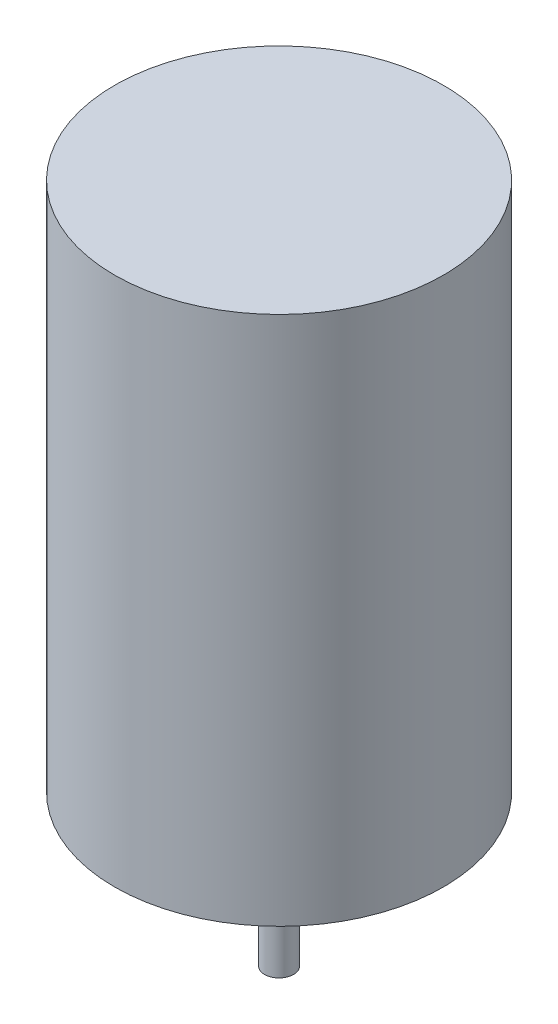
ISO-10303-21;
HEADER;
FILE_DESCRIPTION(('STEP AP214'),'2;1');
FILE_NAME('part.step','',(''),(''),'','','');
FILE_SCHEMA(('AUTOMOTIVE_DESIGN { 1 0 10303 214 1 1 1 1 }'));
ENDSEC;
DATA;
#1=APPLICATION_CONTEXT('core data for automotive mechanical design processes');
#2=APPLICATION_PROTOCOL_DEFINITION('international standard','automotive_design',2000,#1);
#3=PRODUCT_CONTEXT('',#1,'mechanical');
#4=PRODUCT('Part','Part','',(#3));
#5=PRODUCT_RELATED_PRODUCT_CATEGORY('part','',(#4));
#6=PRODUCT_DEFINITION_FORMATION('','',#4);
#7=PRODUCT_DEFINITION_CONTEXT('part definition',#1,'design');
#8=PRODUCT_DEFINITION('design','',#6,#7);
#9=PRODUCT_DEFINITION_SHAPE('','',#8);
#10=(LENGTH_UNIT() NAMED_UNIT(*) SI_UNIT(.MILLI.,.METRE.));
#11=(NAMED_UNIT(*) PLANE_ANGLE_UNIT() SI_UNIT($,.RADIAN.));
#12=(NAMED_UNIT(*) SI_UNIT($,.STERADIAN.) SOLID_ANGLE_UNIT());
#13=UNCERTAINTY_MEASURE_WITH_UNIT(LENGTH_MEASURE(1.E-05),#10,'distance_accuracy_value','');
#14=(GEOMETRIC_REPRESENTATION_CONTEXT(3) GLOBAL_UNCERTAINTY_ASSIGNED_CONTEXT((#13)) GLOBAL_UNIT_ASSIGNED_CONTEXT((#10,
#11,#12)) REPRESENTATION_CONTEXT('',''));
#15=CARTESIAN_POINT('',(0.,0.,0.));
#16=DIRECTION('',(0.,0.,1.));
#17=DIRECTION('',(1.,0.,0.));
#18=AXIS2_PLACEMENT_3D('',#15,#16,#17);
#19=CARTESIAN_POINT('',(0.,58.,0.));
#20=DIRECTION('',(0.,-1.,0.));
#21=DIRECTION('',(0.,0.,-1.));
#22=AXIS2_PLACEMENT_3D('',#19,#20,#21);
#23=CYLINDRICAL_SURFACE('',#22,18.);
#24=CARTESIAN_POINT('',(0.,58.,0.));
#25=DIRECTION('',(0.,1.,0.));
#26=DIRECTION('',(0.,0.,1.));
#27=AXIS2_PLACEMENT_3D('',#24,#25,#26);
#28=CIRCLE('',#27,18.);
#29=CARTESIAN_POINT('',(0.,58.,18.));
#30=VERTEX_POINT('',#29);
#31=EDGE_CURVE('E38',#30,#30,#28,.T.);
#32=ORIENTED_EDGE('',*,*,#31,.F.);
#33=EDGE_LOOP('',(#32));
#34=FACE_BOUND('',#33,.T.);
#35=CARTESIAN_POINT('',(0.,0.,0.));
#36=DIRECTION('',(0.,1.,0.));
#37=DIRECTION('',(0.,0.,1.));
#38=AXIS2_PLACEMENT_3D('',#35,#36,#37);
#39=CIRCLE('',#38,18.);
#40=CARTESIAN_POINT('',(0.,0.,18.));
#41=VERTEX_POINT('',#40);
#42=EDGE_CURVE('E42',#41,#41,#39,.T.);
#43=ORIENTED_EDGE('',*,*,#42,.T.);
#44=EDGE_LOOP('',(#43));
#45=FACE_BOUND('',#44,.T.);
#46=ADVANCED_FACE('F32',(#34,#45),#23,.T.);
#47=CARTESIAN_POINT('',(0.,58.,0.));
#48=DIRECTION('',(0.,1.,0.));
#49=DIRECTION('',(0.,0.,1.));
#50=AXIS2_PLACEMENT_3D('',#47,#48,#49);
#51=PLANE('',#50);
#52=ORIENTED_EDGE('',*,*,#31,.T.);
#53=EDGE_LOOP('',(#52));
#54=FACE_BOUND('',#53,.T.);
#55=ADVANCED_FACE('F89',(#54),#51,.T.);
#56=CARTESIAN_POINT('',(0.,0.,0.));
#57=DIRECTION('',(0.,1.,0.));
#58=DIRECTION('',(0.,0.,1.));
#59=AXIS2_PLACEMENT_3D('',#56,#57,#58);
#60=PLANE('',#59);
#61=CARTESIAN_POINT('',(0.,0.,0.));
#62=DIRECTION('',(0.,1.,0.));
#63=DIRECTION('',(0.,0.,1.));
#64=AXIS2_PLACEMENT_3D('',#61,#62,#63);
#65=CIRCLE('',#64,6.5);
#66=CARTESIAN_POINT('',(0.,0.,6.5));
#67=VERTEX_POINT('',#66);
#68=EDGE_CURVE('E10',#67,#67,#65,.F.);
#69=ORIENTED_EDGE('',*,*,#68,.F.);
#70=EDGE_LOOP('',(#69));
#71=FACE_BOUND('',#70,.T.);
#72=CARTESIAN_POINT('',(-12.5,0.,0.));
#73=DIRECTION('',(0.,-1.,0.));
#74=DIRECTION('',(0.,0.,-1.));
#75=AXIS2_PLACEMENT_3D('',#72,#73,#74);
#76=CIRCLE('',#75,1.5);
#77=CARTESIAN_POINT('',(-12.5,0.,-1.5));
#78=VERTEX_POINT('',#77);
#79=EDGE_CURVE('E58',#78,#78,#76,.T.);
#80=ORIENTED_EDGE('',*,*,#79,.F.);
#81=EDGE_LOOP('',(#80));
#82=FACE_BOUND('',#81,.T.);
#83=CARTESIAN_POINT('',(12.5,0.,0.));
#84=DIRECTION('',(0.,-1.,0.));
#85=DIRECTION('',(0.,0.,-1.));
#86=AXIS2_PLACEMENT_3D('',#83,#84,#85);
#87=CIRCLE('',#86,1.5);
#88=CARTESIAN_POINT('',(12.5,0.,-1.5));
#89=VERTEX_POINT('',#88);
#90=EDGE_CURVE('E52',#89,#89,#87,.T.);
#91=ORIENTED_EDGE('',*,*,#90,.F.);
#92=EDGE_LOOP('',(#91));
#93=FACE_BOUND('',#92,.T.);
#94=ORIENTED_EDGE('',*,*,#42,.F.);
#95=EDGE_LOOP('',(#94));
#96=FACE_BOUND('',#95,.T.);
#97=ADVANCED_FACE('F94',(#71,#82,#93,#96),#60,.F.);
#98=CARTESIAN_POINT('',(12.5,5.,0.));
#99=DIRECTION('',(0.,-1.,0.));
#100=DIRECTION('',(0.,0.,-1.));
#101=AXIS2_PLACEMENT_3D('',#98,#99,#100);
#102=CYLINDRICAL_SURFACE('',#101,1.5);
#103=CARTESIAN_POINT('',(12.5,5.,0.));
#104=DIRECTION('',(0.,-1.,0.));
#105=DIRECTION('',(0.,0.,-1.));
#106=AXIS2_PLACEMENT_3D('',#103,#104,#105);
#107=CIRCLE('',#106,1.5);
#108=CARTESIAN_POINT('',(12.5,5.,-1.5));
#109=VERTEX_POINT('',#108);
#110=EDGE_CURVE('E51',#109,#109,#107,.T.);
#111=ORIENTED_EDGE('',*,*,#110,.F.);
#112=EDGE_LOOP('',(#111));
#113=FACE_BOUND('',#112,.T.);
#114=ORIENTED_EDGE('',*,*,#90,.T.);
#115=EDGE_LOOP('',(#114));
#116=FACE_BOUND('',#115,.T.);
#117=ADVANCED_FACE('F100',(#113,#116),#102,.F.);
#118=CARTESIAN_POINT('',(0.,5.,0.));
#119=DIRECTION('',(0.,-1.,0.));
#120=DIRECTION('',(0.,0.,-1.));
#121=AXIS2_PLACEMENT_3D('',#118,#119,#120);
#122=PLANE('',#121);
#123=ORIENTED_EDGE('',*,*,#110,.T.);
#124=EDGE_LOOP('',(#123));
#125=FACE_BOUND('',#124,.T.);
#126=ADVANCED_FACE('F105',(#125),#122,.T.);
#127=CARTESIAN_POINT('',(-12.5,5.,0.));
#128=DIRECTION('',(0.,-1.,0.));
#129=DIRECTION('',(0.,0.,-1.));
#130=AXIS2_PLACEMENT_3D('',#127,#128,#129);
#131=CYLINDRICAL_SURFACE('',#130,1.5);
#132=CARTESIAN_POINT('',(-12.5,5.,0.));
#133=DIRECTION('',(0.,-1.,0.));
#134=DIRECTION('',(0.,0.,-1.));
#135=AXIS2_PLACEMENT_3D('',#132,#133,#134);
#136=CIRCLE('',#135,1.5);
#137=CARTESIAN_POINT('',(-12.5,5.,-1.5));
#138=VERTEX_POINT('',#137);
#139=EDGE_CURVE('E55',#138,#138,#136,.T.);
#140=ORIENTED_EDGE('',*,*,#139,.F.);
#141=EDGE_LOOP('',(#140));
#142=FACE_BOUND('',#141,.T.);
#143=ORIENTED_EDGE('',*,*,#79,.T.);
#144=EDGE_LOOP('',(#143));
#145=FACE_BOUND('',#144,.T.);
#146=ADVANCED_FACE('F113',(#142,#145),#131,.F.);
#147=CARTESIAN_POINT('',(0.,5.,0.));
#148=DIRECTION('',(0.,-1.,0.));
#149=DIRECTION('',(0.,0.,-1.));
#150=AXIS2_PLACEMENT_3D('',#147,#148,#149);
#151=PLANE('',#150);
#152=ORIENTED_EDGE('',*,*,#139,.T.);
#153=EDGE_LOOP('',(#152));
#154=FACE_BOUND('',#153,.T.);
#155=ADVANCED_FACE('F115',(#154),#151,.T.);
#156=CARTESIAN_POINT('',(0.,-4.5,0.));
#157=DIRECTION('',(0.,1.,0.));
#158=DIRECTION('',(0.,0.,1.));
#159=AXIS2_PLACEMENT_3D('',#156,#157,#158);
#160=CYLINDRICAL_SURFACE('',#159,6.5);
#161=CARTESIAN_POINT('',(0.,-4.5,0.));
#162=DIRECTION('',(0.,-1.,0.));
#163=DIRECTION('',(0.,0.,-1.));
#164=AXIS2_PLACEMENT_3D('',#161,#162,#163);
#165=CIRCLE('',#164,6.5);
#166=CARTESIAN_POINT('',(0.,-4.5,-6.5));
#167=VERTEX_POINT('',#166);
#168=EDGE_CURVE('E61',#167,#167,#165,.T.);
#169=ORIENTED_EDGE('',*,*,#168,.F.);
#170=EDGE_LOOP('',(#169));
#171=FACE_BOUND('',#170,.T.);
#172=ORIENTED_EDGE('',*,*,#68,.T.);
#173=EDGE_LOOP('',(#172));
#174=FACE_BOUND('',#173,.T.);
#175=ADVANCED_FACE('F85',(#171,#174),#160,.T.);
#176=CARTESIAN_POINT('',(0.,-4.5,0.));
#177=DIRECTION('',(0.,-1.,0.));
#178=DIRECTION('',(0.,0.,-1.));
#179=AXIS2_PLACEMENT_3D('',#176,#177,#178);
#180=PLANE('',#179);
#181=CARTESIAN_POINT('',(0.,-4.5,0.));
#182=DIRECTION('',(0.,-1.,0.));
#183=DIRECTION('',(0.,0.,-1.));
#184=AXIS2_PLACEMENT_3D('',#181,#182,#183);
#185=CIRCLE('',#184,1.5875);
#186=CARTESIAN_POINT('',(0.,-4.5,-1.5875));
#187=VERTEX_POINT('',#186);
#188=EDGE_CURVE('E66',#187,#187,#185,.F.);
#189=ORIENTED_EDGE('',*,*,#188,.T.);
#190=EDGE_LOOP('',(#189));
#191=FACE_BOUND('',#190,.T.);
#192=ORIENTED_EDGE('',*,*,#168,.T.);
#193=EDGE_LOOP('',(#192));
#194=FACE_BOUND('',#193,.T.);
#195=ADVANCED_FACE('F70',(#191,#194),#180,.T.);
#196=CARTESIAN_POINT('',(0.,-16.5,0.));
#197=DIRECTION('',(0.,-1.,0.));
#198=DIRECTION('',(0.,0.,-1.));
#199=AXIS2_PLACEMENT_3D('',#196,#197,#198);
#200=PLANE('',#199);
#201=CARTESIAN_POINT('',(0.,-16.5,0.));
#202=DIRECTION('',(0.,-1.,0.));
#203=DIRECTION('',(0.,0.,-1.));
#204=AXIS2_PLACEMENT_3D('',#201,#202,#203);
#205=CIRCLE('',#204,1.5875);
#206=CARTESIAN_POINT('',(0.,-16.5,-1.5875));
#207=VERTEX_POINT('',#206);
#208=EDGE_CURVE('E47',#207,#207,#205,.T.);
#209=ORIENTED_EDGE('',*,*,#208,.T.);
#210=EDGE_LOOP('',(#209));
#211=FACE_BOUND('',#210,.T.);
#212=ADVANCED_FACE('F76',(#211),#200,.T.);
#213=CARTESIAN_POINT('',(0.,-16.5,0.));
#214=DIRECTION('',(0.,1.,0.));
#215=DIRECTION('',(0.,0.,1.));
#216=AXIS2_PLACEMENT_3D('',#213,#214,#215);
#217=CYLINDRICAL_SURFACE('',#216,1.5875);
#218=ORIENTED_EDGE('',*,*,#188,.F.);
#219=EDGE_LOOP('',(#218));
#220=FACE_BOUND('',#219,.T.);
#221=ORIENTED_EDGE('',*,*,#208,.F.);
#222=EDGE_LOOP('',(#221));
#223=FACE_BOUND('',#222,.T.);
#224=ADVANCED_FACE('F73',(#220,#223),#217,.T.);
#225=CLOSED_SHELL('',(#46,#55,#97,#117,#126,#146,#155,#175,#195,#212,#224));
#226=MANIFOLD_SOLID_BREP('B2',#225);
#227=ADVANCED_BREP_SHAPE_REPRESENTATION('',(#18,#226),#14);
#228=SHAPE_DEFINITION_REPRESENTATION(#9,#227);
ENDSEC;
END-ISO-10303-21;
